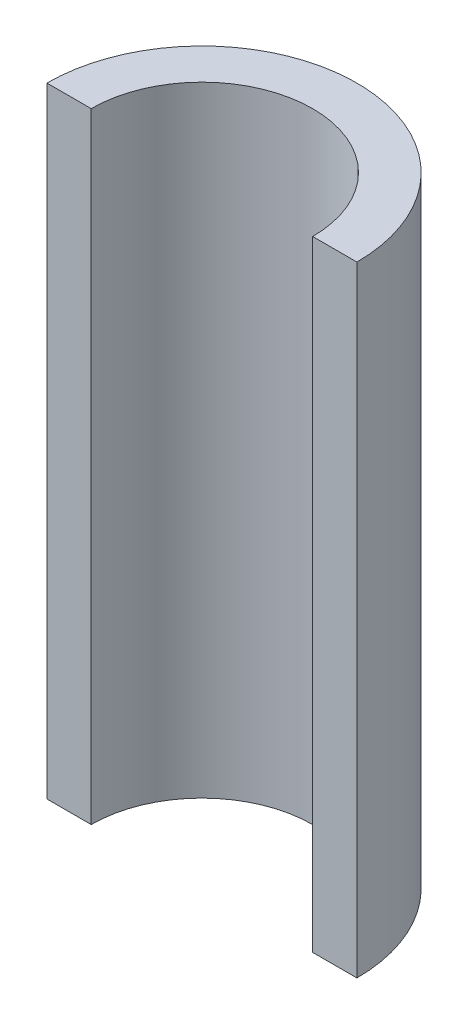
ISO-10303-21;
HEADER;
FILE_DESCRIPTION(('STEP AP214'),'2;1');
FILE_NAME('part.step','',(''),(''),'','','');
FILE_SCHEMA(('AUTOMOTIVE_DESIGN { 1 0 10303 214 1 1 1 1 }'));
ENDSEC;
DATA;
#1=APPLICATION_CONTEXT('core data for automotive mechanical design processes');
#2=APPLICATION_PROTOCOL_DEFINITION('international standard','automotive_design',2000,#1);
#3=PRODUCT_CONTEXT('',#1,'mechanical');
#4=PRODUCT('Part','Part','',(#3));
#5=PRODUCT_RELATED_PRODUCT_CATEGORY('part','',(#4));
#6=PRODUCT_DEFINITION_FORMATION('','',#4);
#7=PRODUCT_DEFINITION_CONTEXT('part definition',#1,'design');
#8=PRODUCT_DEFINITION('design','',#6,#7);
#9=PRODUCT_DEFINITION_SHAPE('','',#8);
#10=(LENGTH_UNIT() NAMED_UNIT(*) SI_UNIT(.MILLI.,.METRE.));
#11=(NAMED_UNIT(*) PLANE_ANGLE_UNIT() SI_UNIT($,.RADIAN.));
#12=(NAMED_UNIT(*) SI_UNIT($,.STERADIAN.) SOLID_ANGLE_UNIT());
#13=UNCERTAINTY_MEASURE_WITH_UNIT(LENGTH_MEASURE(1.E-05),#10,'distance_accuracy_value','');
#14=(GEOMETRIC_REPRESENTATION_CONTEXT(3) GLOBAL_UNCERTAINTY_ASSIGNED_CONTEXT((#13)) GLOBAL_UNIT_ASSIGNED_CONTEXT((#10,
#11,#12)) REPRESENTATION_CONTEXT('',''));
#15=CARTESIAN_POINT('',(0.,0.,0.));
#16=DIRECTION('',(0.,0.,1.));
#17=DIRECTION('',(1.,0.,0.));
#18=AXIS2_PLACEMENT_3D('',#15,#16,#17);
#19=CARTESIAN_POINT('',(0.,70.,0.));
#20=DIRECTION('',(0.,-1.,0.));
#21=DIRECTION('',(0.,0.,-1.));
#22=AXIS2_PLACEMENT_3D('',#19,#20,#21);
#23=CYLINDRICAL_SURFACE('',#22,12.5);
#24=CARTESIAN_POINT('',(0.,0.,0.));
#25=DIRECTION('',(0.,-1.,0.));
#26=DIRECTION('',(0.,0.,1.));
#27=AXIS2_PLACEMENT_3D('',#24,#25,#26);
#28=CIRCLE('',#27,12.5);
#29=CARTESIAN_POINT('',(-12.5,0.,0.));
#30=VERTEX_POINT('',#29);
#31=CARTESIAN_POINT('',(12.5,0.,0.));
#32=VERTEX_POINT('',#31);
#33=EDGE_CURVE('E96',#30,#32,#28,.T.);
#34=ORIENTED_EDGE('',*,*,#33,.T.);
#35=DIRECTION('',(0.,-1.,0.));
#36=VECTOR('',#35,1.);
#37=CARTESIAN_POINT('',(12.5,70.,0.));
#38=LINE('',#37,#36);
#39=CARTESIAN_POINT('',(12.5,70.,0.));
#40=VERTEX_POINT('',#39);
#41=EDGE_CURVE('E11',#40,#32,#38,.T.);
#42=ORIENTED_EDGE('',*,*,#41,.F.);
#43=CARTESIAN_POINT('',(0.,70.,0.));
#44=DIRECTION('',(0.,-1.,0.));
#45=DIRECTION('',(0.,0.,1.));
#46=AXIS2_PLACEMENT_3D('',#43,#44,#45);
#47=CIRCLE('',#46,12.5);
#48=CARTESIAN_POINT('',(-12.5,70.,0.));
#49=VERTEX_POINT('',#48);
#50=EDGE_CURVE('E84',#49,#40,#47,.T.);
#51=ORIENTED_EDGE('',*,*,#50,.F.);
#52=DIRECTION('',(0.,-1.,0.));
#53=VECTOR('',#52,1.);
#54=CARTESIAN_POINT('',(-12.5,70.,0.));
#55=LINE('',#54,#53);
#56=EDGE_CURVE('E92',#49,#30,#55,.T.);
#57=ORIENTED_EDGE('',*,*,#56,.T.);
#58=EDGE_LOOP('',(#34,#42,#51,#57));
#59=FACE_BOUND('',#58,.T.);
#60=ADVANCED_FACE('F33',(#59),#23,.F.);
#61=CARTESIAN_POINT('',(12.5,70.,0.));
#62=DIRECTION('',(0.,0.,-1.));
#63=DIRECTION('',(-1.,0.,0.));
#64=AXIS2_PLACEMENT_3D('',#61,#62,#63);
#65=PLANE('',#64);
#66=DIRECTION('',(1.,0.,0.));
#67=VECTOR('',#66,1.);
#68=CARTESIAN_POINT('',(12.5,0.,0.));
#69=LINE('',#68,#67);
#70=CARTESIAN_POINT('',(17.5,0.,0.));
#71=VERTEX_POINT('',#70);
#72=EDGE_CURVE('E88',#32,#71,#69,.T.);
#73=ORIENTED_EDGE('',*,*,#72,.T.);
#74=DIRECTION('',(0.,-1.,0.));
#75=VECTOR('',#74,1.);
#76=CARTESIAN_POINT('',(17.5,70.,0.));
#77=LINE('',#76,#75);
#78=CARTESIAN_POINT('',(17.5,70.,0.));
#79=VERTEX_POINT('',#78);
#80=EDGE_CURVE('E41',#79,#71,#77,.T.);
#81=ORIENTED_EDGE('',*,*,#80,.F.);
#82=DIRECTION('',(1.,0.,0.));
#83=VECTOR('',#82,1.);
#84=CARTESIAN_POINT('',(12.5,70.,0.));
#85=LINE('',#84,#83);
#86=EDGE_CURVE('E79',#40,#79,#85,.T.);
#87=ORIENTED_EDGE('',*,*,#86,.F.);
#88=ORIENTED_EDGE('',*,*,#41,.T.);
#89=EDGE_LOOP('',(#73,#81,#87,#88));
#90=FACE_BOUND('',#89,.T.);
#91=ADVANCED_FACE('F87',(#90),#65,.F.);
#92=CARTESIAN_POINT('',(0.,70.,0.));
#93=DIRECTION('',(0.,-1.,0.));
#94=DIRECTION('',(0.,0.,-1.));
#95=AXIS2_PLACEMENT_3D('',#92,#93,#94);
#96=CYLINDRICAL_SURFACE('',#95,17.5);
#97=CARTESIAN_POINT('',(0.,0.,0.));
#98=DIRECTION('',(0.,1.,0.));
#99=DIRECTION('',(0.,0.,1.));
#100=AXIS2_PLACEMENT_3D('',#97,#98,#99);
#101=CIRCLE('',#100,17.5);
#102=CARTESIAN_POINT('',(-17.5,0.,0.));
#103=VERTEX_POINT('',#102);
#104=EDGE_CURVE('E66',#71,#103,#101,.T.);
#105=ORIENTED_EDGE('',*,*,#104,.T.);
#106=DIRECTION('',(0.,-1.,0.));
#107=VECTOR('',#106,1.);
#108=CARTESIAN_POINT('',(-17.5,70.,0.));
#109=LINE('',#108,#107);
#110=CARTESIAN_POINT('',(-17.5,70.,0.));
#111=VERTEX_POINT('',#110);
#112=EDGE_CURVE('E89',#111,#103,#109,.T.);
#113=ORIENTED_EDGE('',*,*,#112,.F.);
#114=CARTESIAN_POINT('',(0.,70.,0.));
#115=DIRECTION('',(0.,1.,0.));
#116=DIRECTION('',(0.,0.,1.));
#117=AXIS2_PLACEMENT_3D('',#114,#115,#116);
#118=CIRCLE('',#117,17.5);
#119=EDGE_CURVE('E82',#79,#111,#118,.T.);
#120=ORIENTED_EDGE('',*,*,#119,.F.);
#121=ORIENTED_EDGE('',*,*,#80,.T.);
#122=EDGE_LOOP('',(#105,#113,#120,#121));
#123=FACE_BOUND('',#122,.T.);
#124=ADVANCED_FACE('F90',(#123),#96,.T.);
#125=CARTESIAN_POINT('',(-17.5,70.,0.));
#126=DIRECTION('',(0.,0.,-1.));
#127=DIRECTION('',(-1.,0.,0.));
#128=AXIS2_PLACEMENT_3D('',#125,#126,#127);
#129=PLANE('',#128);
#130=DIRECTION('',(1.,0.,0.));
#131=VECTOR('',#130,1.);
#132=CARTESIAN_POINT('',(-17.5,0.,0.));
#133=LINE('',#132,#131);
#134=EDGE_CURVE('E72',#103,#30,#133,.T.);
#135=ORIENTED_EDGE('',*,*,#134,.T.);
#136=ORIENTED_EDGE('',*,*,#56,.F.);
#137=DIRECTION('',(1.,0.,0.));
#138=VECTOR('',#137,1.);
#139=CARTESIAN_POINT('',(-17.5,70.,0.));
#140=LINE('',#139,#138);
#141=EDGE_CURVE('E49',#111,#49,#140,.T.);
#142=ORIENTED_EDGE('',*,*,#141,.F.);
#143=ORIENTED_EDGE('',*,*,#112,.T.);
#144=EDGE_LOOP('',(#135,#136,#142,#143));
#145=FACE_BOUND('',#144,.T.);
#146=ADVANCED_FACE('F103',(#145),#129,.F.);
#147=CARTESIAN_POINT('',(0.,70.,0.));
#148=DIRECTION('',(0.,1.,0.));
#149=DIRECTION('',(0.,0.,1.));
#150=AXIS2_PLACEMENT_3D('',#147,#148,#149);
#151=PLANE('',#150);
#152=ORIENTED_EDGE('',*,*,#50,.T.);
#153=ORIENTED_EDGE('',*,*,#86,.T.);
#154=ORIENTED_EDGE('',*,*,#119,.T.);
#155=ORIENTED_EDGE('',*,*,#141,.T.);
#156=EDGE_LOOP('',(#152,#153,#154,#155));
#157=FACE_BOUND('',#156,.T.);
#158=ADVANCED_FACE('F80',(#157),#151,.T.);
#159=CARTESIAN_POINT('',(0.,0.,0.));
#160=DIRECTION('',(0.,1.,0.));
#161=DIRECTION('',(0.,0.,1.));
#162=AXIS2_PLACEMENT_3D('',#159,#160,#161);
#163=PLANE('',#162);
#164=ORIENTED_EDGE('',*,*,#33,.F.);
#165=ORIENTED_EDGE('',*,*,#134,.F.);
#166=ORIENTED_EDGE('',*,*,#104,.F.);
#167=ORIENTED_EDGE('',*,*,#72,.F.);
#168=EDGE_LOOP('',(#164,#165,#166,#167));
#169=FACE_BOUND('',#168,.T.);
#170=ADVANCED_FACE('F106',(#169),#163,.F.);
#171=CLOSED_SHELL('',(#60,#91,#124,#146,#158,#170));
#172=MANIFOLD_SOLID_BREP('B2',#171);
#173=ADVANCED_BREP_SHAPE_REPRESENTATION('',(#18,#172),#14);
#174=SHAPE_DEFINITION_REPRESENTATION(#9,#173);
ENDSEC;
END-ISO-10303-21;
